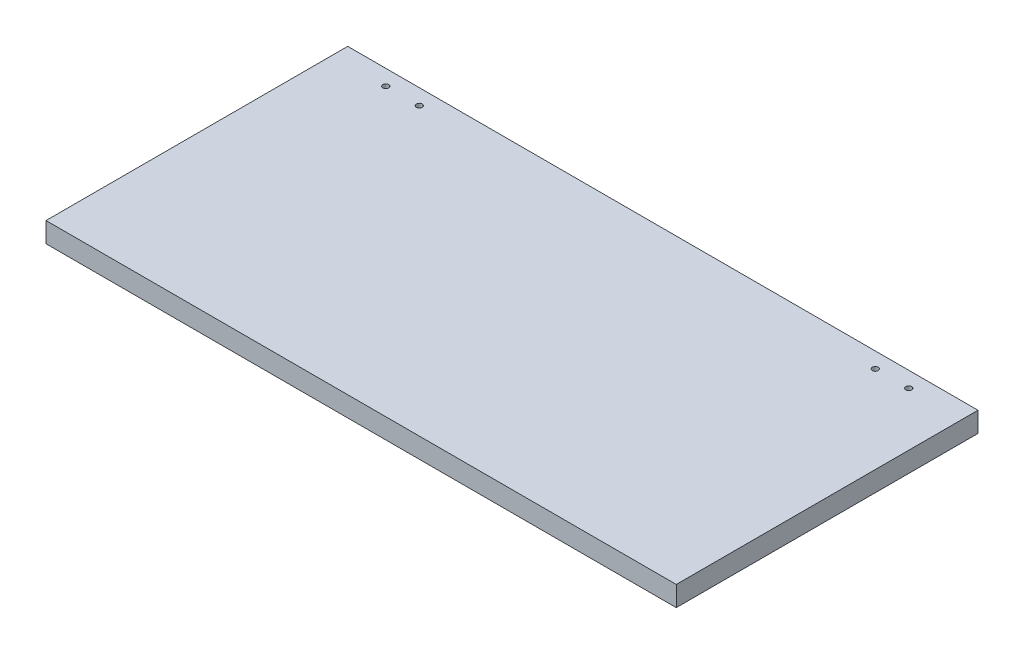
ISO-10303-21;
HEADER;
FILE_DESCRIPTION(('STEP AP214'),'2;1');
FILE_NAME('part.step','',(''),(''),'','','');
FILE_SCHEMA(('AUTOMOTIVE_DESIGN { 1 0 10303 214 1 1 1 1 }'));
ENDSEC;
DATA;
#1=APPLICATION_CONTEXT('core data for automotive mechanical design processes');
#2=APPLICATION_PROTOCOL_DEFINITION('international standard','automotive_design',2000,#1);
#3=PRODUCT_CONTEXT('',#1,'mechanical');
#4=PRODUCT('Part','Part','',(#3));
#5=PRODUCT_RELATED_PRODUCT_CATEGORY('part','',(#4));
#6=PRODUCT_DEFINITION_FORMATION('','',#4);
#7=PRODUCT_DEFINITION_CONTEXT('part definition',#1,'design');
#8=PRODUCT_DEFINITION('design','',#6,#7);
#9=PRODUCT_DEFINITION_SHAPE('','',#8);
#10=(LENGTH_UNIT() NAMED_UNIT(*) SI_UNIT(.MILLI.,.METRE.));
#11=(NAMED_UNIT(*) PLANE_ANGLE_UNIT() SI_UNIT($,.RADIAN.));
#12=(NAMED_UNIT(*) SI_UNIT($,.STERADIAN.) SOLID_ANGLE_UNIT());
#13=UNCERTAINTY_MEASURE_WITH_UNIT(LENGTH_MEASURE(1.E-05),#10,'distance_accuracy_value','');
#14=(GEOMETRIC_REPRESENTATION_CONTEXT(3) GLOBAL_UNCERTAINTY_ASSIGNED_CONTEXT((#13)) GLOBAL_UNIT_ASSIGNED_CONTEXT((#10,
#11,#12)) REPRESENTATION_CONTEXT('',''));
#15=CARTESIAN_POINT('',(0.,0.,0.));
#16=DIRECTION('',(0.,0.,1.));
#17=DIRECTION('',(1.,0.,0.));
#18=AXIS2_PLACEMENT_3D('',#15,#16,#17);
#19=CARTESIAN_POINT('',(235.,15.,-112.5));
#20=DIRECTION('',(-1.,0.,0.));
#21=DIRECTION('',(0.,0.,1.));
#22=AXIS2_PLACEMENT_3D('',#19,#20,#21);
#23=PLANE('',#22);
#24=DIRECTION('',(0.,0.,-1.));
#25=VECTOR('',#24,1.);
#26=CARTESIAN_POINT('',(235.,0.,-112.5));
#27=LINE('',#26,#25);
#28=CARTESIAN_POINT('',(235.,0.,112.5));
#29=VERTEX_POINT('',#28);
#30=CARTESIAN_POINT('',(235.,0.,-112.5));
#31=VERTEX_POINT('',#30);
#32=EDGE_CURVE('E95',#29,#31,#27,.T.);
#33=ORIENTED_EDGE('',*,*,#32,.T.);
#34=DIRECTION('',(0.,-1.,0.));
#35=VECTOR('',#34,1.);
#36=CARTESIAN_POINT('',(235.,15.,-112.5));
#37=LINE('',#36,#35);
#38=CARTESIAN_POINT('',(235.,15.,-112.5));
#39=VERTEX_POINT('',#38);
#40=EDGE_CURVE('E11',#39,#31,#37,.T.);
#41=ORIENTED_EDGE('',*,*,#40,.F.);
#42=DIRECTION('',(0.,0.,-1.));
#43=VECTOR('',#42,1.);
#44=CARTESIAN_POINT('',(235.,15.,-112.5));
#45=LINE('',#44,#43);
#46=CARTESIAN_POINT('',(235.,15.,112.5));
#47=VERTEX_POINT('',#46);
#48=EDGE_CURVE('E83',#47,#39,#45,.T.);
#49=ORIENTED_EDGE('',*,*,#48,.F.);
#50=DIRECTION('',(0.,-1.,0.));
#51=VECTOR('',#50,1.);
#52=CARTESIAN_POINT('',(235.,15.,112.5));
#53=LINE('',#52,#51);
#54=EDGE_CURVE('E91',#47,#29,#53,.T.);
#55=ORIENTED_EDGE('',*,*,#54,.T.);
#56=EDGE_LOOP('',(#33,#41,#49,#55));
#57=FACE_BOUND('',#56,.T.);
#58=ADVANCED_FACE('F32',(#57),#23,.F.);
#59=CARTESIAN_POINT('',(-235.,15.,-112.5));
#60=DIRECTION('',(0.,0.,1.));
#61=DIRECTION('',(1.,0.,0.));
#62=AXIS2_PLACEMENT_3D('',#59,#60,#61);
#63=PLANE('',#62);
#64=DIRECTION('',(-1.,0.,0.));
#65=VECTOR('',#64,1.);
#66=CARTESIAN_POINT('',(-235.,0.,-112.5));
#67=LINE('',#66,#65);
#68=CARTESIAN_POINT('',(-235.,0.,-112.5));
#69=VERTEX_POINT('',#68);
#70=EDGE_CURVE('E87',#31,#69,#67,.T.);
#71=ORIENTED_EDGE('',*,*,#70,.T.);
#72=DIRECTION('',(0.,-1.,0.));
#73=VECTOR('',#72,1.);
#74=CARTESIAN_POINT('',(-235.,15.,-112.5));
#75=LINE('',#74,#73);
#76=CARTESIAN_POINT('',(-235.,15.,-112.5));
#77=VERTEX_POINT('',#76);
#78=EDGE_CURVE('E40',#77,#69,#75,.T.);
#79=ORIENTED_EDGE('',*,*,#78,.F.);
#80=DIRECTION('',(-1.,0.,0.));
#81=VECTOR('',#80,1.);
#82=CARTESIAN_POINT('',(-235.,15.,-112.5));
#83=LINE('',#82,#81);
#84=EDGE_CURVE('E78',#39,#77,#83,.T.);
#85=ORIENTED_EDGE('',*,*,#84,.F.);
#86=ORIENTED_EDGE('',*,*,#40,.T.);
#87=EDGE_LOOP('',(#71,#79,#85,#86));
#88=FACE_BOUND('',#87,.T.);
#89=ADVANCED_FACE('F86',(#88),#63,.F.);
#90=CARTESIAN_POINT('',(-235.,15.,-112.5));
#91=DIRECTION('',(1.,0.,0.));
#92=DIRECTION('',(0.,0.,-1.));
#93=AXIS2_PLACEMENT_3D('',#90,#91,#92);
#94=PLANE('',#93);
#95=DIRECTION('',(0.,0.,1.));
#96=VECTOR('',#95,1.);
#97=CARTESIAN_POINT('',(-235.,0.,-112.5));
#98=LINE('',#97,#96);
#99=CARTESIAN_POINT('',(-235.,0.,112.5));
#100=VERTEX_POINT('',#99);
#101=EDGE_CURVE('E65',#69,#100,#98,.T.);
#102=ORIENTED_EDGE('',*,*,#101,.T.);
#103=DIRECTION('',(0.,-1.,0.));
#104=VECTOR('',#103,1.);
#105=CARTESIAN_POINT('',(-235.,15.,112.5));
#106=LINE('',#105,#104);
#107=CARTESIAN_POINT('',(-235.,15.,112.5));
#108=VERTEX_POINT('',#107);
#109=EDGE_CURVE('E88',#108,#100,#106,.T.);
#110=ORIENTED_EDGE('',*,*,#109,.F.);
#111=DIRECTION('',(0.,0.,1.));
#112=VECTOR('',#111,1.);
#113=CARTESIAN_POINT('',(-235.,15.,-112.5));
#114=LINE('',#113,#112);
#115=EDGE_CURVE('E81',#77,#108,#114,.T.);
#116=ORIENTED_EDGE('',*,*,#115,.F.);
#117=ORIENTED_EDGE('',*,*,#78,.T.);
#118=EDGE_LOOP('',(#102,#110,#116,#117));
#119=FACE_BOUND('',#118,.T.);
#120=ADVANCED_FACE('F89',(#119),#94,.F.);
#121=CARTESIAN_POINT('',(-235.,15.,112.5));
#122=DIRECTION('',(0.,0.,-1.));
#123=DIRECTION('',(-1.,0.,0.));
#124=AXIS2_PLACEMENT_3D('',#121,#122,#123);
#125=PLANE('',#124);
#126=DIRECTION('',(1.,0.,0.));
#127=VECTOR('',#126,1.);
#128=CARTESIAN_POINT('',(-235.,0.,112.5));
#129=LINE('',#128,#127);
#130=EDGE_CURVE('E71',#100,#29,#129,.T.);
#131=ORIENTED_EDGE('',*,*,#130,.T.);
#132=ORIENTED_EDGE('',*,*,#54,.F.);
#133=DIRECTION('',(1.,0.,0.));
#134=VECTOR('',#133,1.);
#135=CARTESIAN_POINT('',(-235.,15.,112.5));
#136=LINE('',#135,#134);
#137=EDGE_CURVE('E48',#108,#47,#136,.T.);
#138=ORIENTED_EDGE('',*,*,#137,.F.);
#139=ORIENTED_EDGE('',*,*,#109,.T.);
#140=EDGE_LOOP('',(#131,#132,#138,#139));
#141=FACE_BOUND('',#140,.T.);
#142=ADVANCED_FACE('F103',(#141),#125,.F.);
#143=CARTESIAN_POINT('',(0.,15.,0.));
#144=DIRECTION('',(0.,1.,0.));
#145=DIRECTION('',(0.,0.,1.));
#146=AXIS2_PLACEMENT_3D('',#143,#144,#145);
#147=PLANE('',#146);
#148=CARTESIAN_POINT('',(170.000001969325,15.,-100.909922976691));
#149=DIRECTION('',(0.,1.,0.));
#150=DIRECTION('',(0.,0.,1.));
#151=AXIS2_PLACEMENT_3D('',#148,#149,#150);
#152=CIRCLE('',#151,2.19999999998467);
#153=CARTESIAN_POINT('',(170.000001969325,15.,-98.7099229767064));
#154=VERTEX_POINT('',#153);
#155=EDGE_CURVE('E127',#154,#154,#152,.T.);
#156=ORIENTED_EDGE('',*,*,#155,.F.);
#157=EDGE_LOOP('',(#156));
#158=FACE_BOUND('',#157,.T.);
#159=CARTESIAN_POINT('',(195.,15.,-100.9));
#160=DIRECTION('',(0.,1.,0.));
#161=DIRECTION('',(0.,0.,1.));
#162=AXIS2_PLACEMENT_3D('',#159,#160,#161);
#163=CIRCLE('',#162,2.20000000000001);
#164=CARTESIAN_POINT('',(195.,15.,-98.7));
#165=VERTEX_POINT('',#164);
#166=EDGE_CURVE('E121',#165,#165,#163,.T.);
#167=ORIENTED_EDGE('',*,*,#166,.F.);
#168=EDGE_LOOP('',(#167));
#169=FACE_BOUND('',#168,.T.);
#170=CARTESIAN_POINT('',(-170.,15.,-100.9));
#171=DIRECTION('',(0.,1.,0.));
#172=DIRECTION('',(0.,0.,1.));
#173=AXIS2_PLACEMENT_3D('',#170,#171,#172);
#174=CIRCLE('',#173,2.20000000000001);
#175=CARTESIAN_POINT('',(-170.,15.,-98.7));
#176=VERTEX_POINT('',#175);
#177=EDGE_CURVE('E115',#176,#176,#174,.T.);
#178=ORIENTED_EDGE('',*,*,#177,.F.);
#179=EDGE_LOOP('',(#178));
#180=FACE_BOUND('',#179,.T.);
#181=CARTESIAN_POINT('',(-195.,15.,-100.9));
#182=DIRECTION('',(0.,1.,0.));
#183=DIRECTION('',(0.,0.,1.));
#184=AXIS2_PLACEMENT_3D('',#181,#182,#183);
#185=CIRCLE('',#184,2.20000000000001);
#186=CARTESIAN_POINT('',(-195.,15.,-98.7));
#187=VERTEX_POINT('',#186);
#188=EDGE_CURVE('E109',#187,#187,#185,.T.);
#189=ORIENTED_EDGE('',*,*,#188,.F.);
#190=EDGE_LOOP('',(#189));
#191=FACE_BOUND('',#190,.T.);
#192=ORIENTED_EDGE('',*,*,#48,.T.);
#193=ORIENTED_EDGE('',*,*,#84,.T.);
#194=ORIENTED_EDGE('',*,*,#115,.T.);
#195=ORIENTED_EDGE('',*,*,#137,.T.);
#196=EDGE_LOOP('',(#192,#193,#194,#195));
#197=FACE_BOUND('',#196,.T.);
#198=ADVANCED_FACE('F79',(#158,#169,#180,#191,#197),#147,.T.);
#199=CARTESIAN_POINT('',(0.,0.,0.));
#200=DIRECTION('',(0.,1.,0.));
#201=DIRECTION('',(0.,0.,1.));
#202=AXIS2_PLACEMENT_3D('',#199,#200,#201);
#203=PLANE('',#202);
#204=CARTESIAN_POINT('',(170.000001969325,0.,-100.909922976691));
#205=DIRECTION('',(0.,1.,0.));
#206=DIRECTION('',(0.,0.,1.));
#207=AXIS2_PLACEMENT_3D('',#204,#205,#206);
#208=CIRCLE('',#207,2.19999999998467);
#209=CARTESIAN_POINT('',(170.000001969325,0.,-98.7099229767064));
#210=VERTEX_POINT('',#209);
#211=EDGE_CURVE('E124',#210,#210,#208,.T.);
#212=ORIENTED_EDGE('',*,*,#211,.T.);
#213=EDGE_LOOP('',(#212));
#214=FACE_BOUND('',#213,.T.);
#215=CARTESIAN_POINT('',(195.,0.,-100.9));
#216=DIRECTION('',(0.,1.,0.));
#217=DIRECTION('',(0.,0.,1.));
#218=AXIS2_PLACEMENT_3D('',#215,#216,#217);
#219=CIRCLE('',#218,2.20000000000001);
#220=CARTESIAN_POINT('',(195.,0.,-98.7));
#221=VERTEX_POINT('',#220);
#222=EDGE_CURVE('E118',#221,#221,#219,.T.);
#223=ORIENTED_EDGE('',*,*,#222,.T.);
#224=EDGE_LOOP('',(#223));
#225=FACE_BOUND('',#224,.T.);
#226=CARTESIAN_POINT('',(-170.,0.,-100.9));
#227=DIRECTION('',(0.,1.,0.));
#228=DIRECTION('',(0.,0.,1.));
#229=AXIS2_PLACEMENT_3D('',#226,#227,#228);
#230=CIRCLE('',#229,2.20000000000001);
#231=CARTESIAN_POINT('',(-170.,0.,-98.7));
#232=VERTEX_POINT('',#231);
#233=EDGE_CURVE('E112',#232,#232,#230,.T.);
#234=ORIENTED_EDGE('',*,*,#233,.T.);
#235=EDGE_LOOP('',(#234));
#236=FACE_BOUND('',#235,.T.);
#237=CARTESIAN_POINT('',(-195.,0.,-100.9));
#238=DIRECTION('',(0.,1.,0.));
#239=DIRECTION('',(0.,0.,1.));
#240=AXIS2_PLACEMENT_3D('',#237,#238,#239);
#241=CIRCLE('',#240,2.20000000000001);
#242=CARTESIAN_POINT('',(-195.,0.,-98.7));
#243=VERTEX_POINT('',#242);
#244=EDGE_CURVE('E98',#243,#243,#241,.T.);
#245=ORIENTED_EDGE('',*,*,#244,.T.);
#246=EDGE_LOOP('',(#245));
#247=FACE_BOUND('',#246,.T.);
#248=ORIENTED_EDGE('',*,*,#32,.F.);
#249=ORIENTED_EDGE('',*,*,#130,.F.);
#250=ORIENTED_EDGE('',*,*,#101,.F.);
#251=ORIENTED_EDGE('',*,*,#70,.F.);
#252=EDGE_LOOP('',(#248,#249,#250,#251));
#253=FACE_BOUND('',#252,.T.);
#254=ADVANCED_FACE('F106',(#214,#225,#236,#247,#253),#203,.F.);
#255=CARTESIAN_POINT('',(-195.,0.,-100.9));
#256=DIRECTION('',(0.,1.,0.));
#257=DIRECTION('',(0.,0.,1.));
#258=AXIS2_PLACEMENT_3D('',#255,#256,#257);
#259=CYLINDRICAL_SURFACE('',#258,2.20000000000001);
#260=ORIENTED_EDGE('',*,*,#244,.F.);
#261=EDGE_LOOP('',(#260));
#262=FACE_BOUND('',#261,.T.);
#263=ORIENTED_EDGE('',*,*,#188,.T.);
#264=EDGE_LOOP('',(#263));
#265=FACE_BOUND('',#264,.T.);
#266=ADVANCED_FACE('F151',(#262,#265),#259,.F.);
#267=CARTESIAN_POINT('',(-170.,0.,-100.9));
#268=DIRECTION('',(0.,1.,0.));
#269=DIRECTION('',(0.,0.,1.));
#270=AXIS2_PLACEMENT_3D('',#267,#268,#269);
#271=CYLINDRICAL_SURFACE('',#270,2.20000000000001);
#272=ORIENTED_EDGE('',*,*,#233,.F.);
#273=EDGE_LOOP('',(#272));
#274=FACE_BOUND('',#273,.T.);
#275=ORIENTED_EDGE('',*,*,#177,.T.);
#276=EDGE_LOOP('',(#275));
#277=FACE_BOUND('',#276,.T.);
#278=ADVANCED_FACE('F153',(#274,#277),#271,.F.);
#279=CARTESIAN_POINT('',(195.,0.,-100.9));
#280=DIRECTION('',(0.,1.,0.));
#281=DIRECTION('',(0.,0.,1.));
#282=AXIS2_PLACEMENT_3D('',#279,#280,#281);
#283=CYLINDRICAL_SURFACE('',#282,2.20000000000001);
#284=ORIENTED_EDGE('',*,*,#222,.F.);
#285=EDGE_LOOP('',(#284));
#286=FACE_BOUND('',#285,.T.);
#287=ORIENTED_EDGE('',*,*,#166,.T.);
#288=EDGE_LOOP('',(#287));
#289=FACE_BOUND('',#288,.T.);
#290=ADVANCED_FACE('F138',(#286,#289),#283,.F.);
#291=CARTESIAN_POINT('',(170.000001969325,0.,-100.909922976691));
#292=DIRECTION('',(0.,1.,0.));
#293=DIRECTION('',(0.,0.,1.));
#294=AXIS2_PLACEMENT_3D('',#291,#292,#293);
#295=CYLINDRICAL_SURFACE('',#294,2.19999999998467);
#296=ORIENTED_EDGE('',*,*,#211,.F.);
#297=EDGE_LOOP('',(#296));
#298=FACE_BOUND('',#297,.T.);
#299=ORIENTED_EDGE('',*,*,#155,.T.);
#300=EDGE_LOOP('',(#299));
#301=FACE_BOUND('',#300,.T.);
#302=ADVANCED_FACE('F135',(#298,#301),#295,.F.);
#303=CLOSED_SHELL('',(#58,#89,#120,#142,#198,#254,#266,#278,#290,#302));
#304=MANIFOLD_SOLID_BREP('B2',#303);
#305=ADVANCED_BREP_SHAPE_REPRESENTATION('',(#18,#304),#14);
#306=SHAPE_DEFINITION_REPRESENTATION(#9,#305);
ENDSEC;
END-ISO-10303-21;
